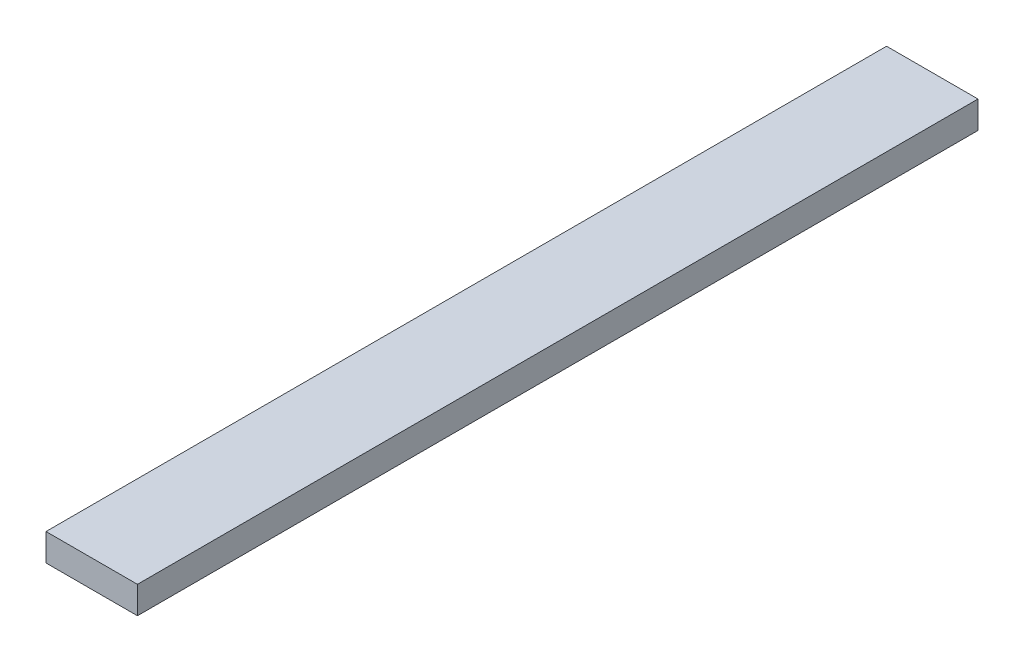
ISO-10303-21;
HEADER;
FILE_DESCRIPTION(('STEP AP214'),'2;1');
FILE_NAME('part.step','',(''),(''),'','','');
FILE_SCHEMA(('AUTOMOTIVE_DESIGN { 1 0 10303 214 1 1 1 1 }'));
ENDSEC;
DATA;
#1=APPLICATION_CONTEXT('core data for automotive mechanical design processes');
#2=APPLICATION_PROTOCOL_DEFINITION('international standard','automotive_design',2000,#1);
#3=PRODUCT_CONTEXT('',#1,'mechanical');
#4=PRODUCT('Part','Part','',(#3));
#5=PRODUCT_RELATED_PRODUCT_CATEGORY('part','',(#4));
#6=PRODUCT_DEFINITION_FORMATION('','',#4);
#7=PRODUCT_DEFINITION_CONTEXT('part definition',#1,'design');
#8=PRODUCT_DEFINITION('design','',#6,#7);
#9=PRODUCT_DEFINITION_SHAPE('','',#8);
#10=(LENGTH_UNIT() NAMED_UNIT(*) SI_UNIT(.MILLI.,.METRE.));
#11=(NAMED_UNIT(*) PLANE_ANGLE_UNIT() SI_UNIT($,.RADIAN.));
#12=(NAMED_UNIT(*) SI_UNIT($,.STERADIAN.) SOLID_ANGLE_UNIT());
#13=UNCERTAINTY_MEASURE_WITH_UNIT(LENGTH_MEASURE(1.E-05),#10,'distance_accuracy_value','');
#14=(GEOMETRIC_REPRESENTATION_CONTEXT(3) GLOBAL_UNCERTAINTY_ASSIGNED_CONTEXT((#13)) GLOBAL_UNIT_ASSIGNED_CONTEXT((#10,
#11,#12)) REPRESENTATION_CONTEXT('',''));
#15=CARTESIAN_POINT('',(0.,0.,0.));
#16=DIRECTION('',(0.,0.,1.));
#17=DIRECTION('',(1.,0.,0.));
#18=AXIS2_PLACEMENT_3D('',#15,#16,#17);
#19=CARTESIAN_POINT('',(-10.0623058987491,3.,185.));
#20=DIRECTION('',(1.,0.,0.));
#21=DIRECTION('',(0.,0.,-1.));
#22=AXIS2_PLACEMENT_3D('',#19,#20,#21);
#23=PLANE('',#22);
#24=DIRECTION('',(0.,-1.,0.));
#25=VECTOR('',#24,1.);
#26=CARTESIAN_POINT('',(-10.0623058987491,3.,0.));
#27=LINE('',#26,#25);
#28=CARTESIAN_POINT('',(-10.0623058987491,3.,0.));
#29=VERTEX_POINT('',#28);
#30=CARTESIAN_POINT('',(-10.0623058987491,-3.,0.));
#31=VERTEX_POINT('',#30);
#32=EDGE_CURVE('E96',#29,#31,#27,.T.);
#33=ORIENTED_EDGE('',*,*,#32,.T.);
#34=DIRECTION('',(0.,0.,-1.));
#35=VECTOR('',#34,1.);
#36=CARTESIAN_POINT('',(-10.0623058987491,-3.,185.));
#37=LINE('',#36,#35);
#38=CARTESIAN_POINT('',(-10.0623058987491,-3.,185.));
#39=VERTEX_POINT('',#38);
#40=EDGE_CURVE('E11',#39,#31,#37,.T.);
#41=ORIENTED_EDGE('',*,*,#40,.F.);
#42=DIRECTION('',(0.,-1.,0.));
#43=VECTOR('',#42,1.);
#44=CARTESIAN_POINT('',(-10.0623058987491,3.,185.));
#45=LINE('',#44,#43);
#46=CARTESIAN_POINT('',(-10.0623058987491,3.,185.));
#47=VERTEX_POINT('',#46);
#48=EDGE_CURVE('E84',#47,#39,#45,.T.);
#49=ORIENTED_EDGE('',*,*,#48,.F.);
#50=DIRECTION('',(0.,0.,-1.));
#51=VECTOR('',#50,1.);
#52=CARTESIAN_POINT('',(-10.0623058987491,3.,185.));
#53=LINE('',#52,#51);
#54=EDGE_CURVE('E92',#47,#29,#53,.T.);
#55=ORIENTED_EDGE('',*,*,#54,.T.);
#56=EDGE_LOOP('',(#33,#41,#49,#55));
#57=FACE_BOUND('',#56,.T.);
#58=ADVANCED_FACE('F33',(#57),#23,.F.);
#59=CARTESIAN_POINT('',(-10.0623058987491,-3.,185.));
#60=DIRECTION('',(0.,1.,0.));
#61=DIRECTION('',(0.,0.,1.));
#62=AXIS2_PLACEMENT_3D('',#59,#60,#61);
#63=PLANE('',#62);
#64=DIRECTION('',(1.,0.,0.));
#65=VECTOR('',#64,1.);
#66=CARTESIAN_POINT('',(-10.0623058987491,-3.,0.));
#67=LINE('',#66,#65);
#68=CARTESIAN_POINT('',(10.0623058987491,-3.,0.));
#69=VERTEX_POINT('',#68);
#70=EDGE_CURVE('E88',#31,#69,#67,.T.);
#71=ORIENTED_EDGE('',*,*,#70,.T.);
#72=DIRECTION('',(0.,0.,-1.));
#73=VECTOR('',#72,1.);
#74=CARTESIAN_POINT('',(10.0623058987491,-3.,185.));
#75=LINE('',#74,#73);
#76=CARTESIAN_POINT('',(10.0623058987491,-3.,185.));
#77=VERTEX_POINT('',#76);
#78=EDGE_CURVE('E41',#77,#69,#75,.T.);
#79=ORIENTED_EDGE('',*,*,#78,.F.);
#80=DIRECTION('',(1.,0.,0.));
#81=VECTOR('',#80,1.);
#82=CARTESIAN_POINT('',(-10.0623058987491,-3.,185.));
#83=LINE('',#82,#81);
#84=EDGE_CURVE('E79',#39,#77,#83,.T.);
#85=ORIENTED_EDGE('',*,*,#84,.F.);
#86=ORIENTED_EDGE('',*,*,#40,.T.);
#87=EDGE_LOOP('',(#71,#79,#85,#86));
#88=FACE_BOUND('',#87,.T.);
#89=ADVANCED_FACE('F87',(#88),#63,.F.);
#90=CARTESIAN_POINT('',(10.0623058987491,3.,185.));
#91=DIRECTION('',(-1.,0.,0.));
#92=DIRECTION('',(0.,0.,1.));
#93=AXIS2_PLACEMENT_3D('',#90,#91,#92);
#94=PLANE('',#93);
#95=DIRECTION('',(0.,1.,0.));
#96=VECTOR('',#95,1.);
#97=CARTESIAN_POINT('',(10.0623058987491,3.,0.));
#98=LINE('',#97,#96);
#99=CARTESIAN_POINT('',(10.0623058987491,3.,0.));
#100=VERTEX_POINT('',#99);
#101=EDGE_CURVE('E66',#69,#100,#98,.T.);
#102=ORIENTED_EDGE('',*,*,#101,.T.);
#103=DIRECTION('',(0.,0.,-1.));
#104=VECTOR('',#103,1.);
#105=CARTESIAN_POINT('',(10.0623058987491,3.,185.));
#106=LINE('',#105,#104);
#107=CARTESIAN_POINT('',(10.0623058987491,3.,185.));
#108=VERTEX_POINT('',#107);
#109=EDGE_CURVE('E89',#108,#100,#106,.T.);
#110=ORIENTED_EDGE('',*,*,#109,.F.);
#111=DIRECTION('',(0.,1.,0.));
#112=VECTOR('',#111,1.);
#113=CARTESIAN_POINT('',(10.0623058987491,3.,185.));
#114=LINE('',#113,#112);
#115=EDGE_CURVE('E82',#77,#108,#114,.T.);
#116=ORIENTED_EDGE('',*,*,#115,.F.);
#117=ORIENTED_EDGE('',*,*,#78,.T.);
#118=EDGE_LOOP('',(#102,#110,#116,#117));
#119=FACE_BOUND('',#118,.T.);
#120=ADVANCED_FACE('F90',(#119),#94,.F.);
#121=CARTESIAN_POINT('',(-10.0623058987491,3.,185.));
#122=DIRECTION('',(0.,-1.,0.));
#123=DIRECTION('',(0.,0.,-1.));
#124=AXIS2_PLACEMENT_3D('',#121,#122,#123);
#125=PLANE('',#124);
#126=DIRECTION('',(-1.,0.,0.));
#127=VECTOR('',#126,1.);
#128=CARTESIAN_POINT('',(-10.0623058987491,3.,0.));
#129=LINE('',#128,#127);
#130=EDGE_CURVE('E72',#100,#29,#129,.T.);
#131=ORIENTED_EDGE('',*,*,#130,.T.);
#132=ORIENTED_EDGE('',*,*,#54,.F.);
#133=DIRECTION('',(-1.,0.,0.));
#134=VECTOR('',#133,1.);
#135=CARTESIAN_POINT('',(-10.0623058987491,3.,185.));
#136=LINE('',#135,#134);
#137=EDGE_CURVE('E49',#108,#47,#136,.T.);
#138=ORIENTED_EDGE('',*,*,#137,.F.);
#139=ORIENTED_EDGE('',*,*,#109,.T.);
#140=EDGE_LOOP('',(#131,#132,#138,#139));
#141=FACE_BOUND('',#140,.T.);
#142=ADVANCED_FACE('F103',(#141),#125,.F.);
#143=CARTESIAN_POINT('',(0.,0.,185.));
#144=DIRECTION('',(0.,0.,1.));
#145=DIRECTION('',(1.,0.,0.));
#146=AXIS2_PLACEMENT_3D('',#143,#144,#145);
#147=PLANE('',#146);
#148=ORIENTED_EDGE('',*,*,#48,.T.);
#149=ORIENTED_EDGE('',*,*,#84,.T.);
#150=ORIENTED_EDGE('',*,*,#115,.T.);
#151=ORIENTED_EDGE('',*,*,#137,.T.);
#152=EDGE_LOOP('',(#148,#149,#150,#151));
#153=FACE_BOUND('',#152,.T.);
#154=ADVANCED_FACE('F80',(#153),#147,.T.);
#155=CARTESIAN_POINT('',(0.,0.,0.));
#156=DIRECTION('',(0.,0.,1.));
#157=DIRECTION('',(1.,0.,0.));
#158=AXIS2_PLACEMENT_3D('',#155,#156,#157);
#159=PLANE('',#158);
#160=ORIENTED_EDGE('',*,*,#32,.F.);
#161=ORIENTED_EDGE('',*,*,#130,.F.);
#162=ORIENTED_EDGE('',*,*,#101,.F.);
#163=ORIENTED_EDGE('',*,*,#70,.F.);
#164=EDGE_LOOP('',(#160,#161,#162,#163));
#165=FACE_BOUND('',#164,.T.);
#166=ADVANCED_FACE('F106',(#165),#159,.F.);
#167=CLOSED_SHELL('',(#58,#89,#120,#142,#154,#166));
#168=MANIFOLD_SOLID_BREP('B2',#167);
#169=ADVANCED_BREP_SHAPE_REPRESENTATION('',(#18,#168),#14);
#170=SHAPE_DEFINITION_REPRESENTATION(#9,#169);
ENDSEC;
END-ISO-10303-21;
